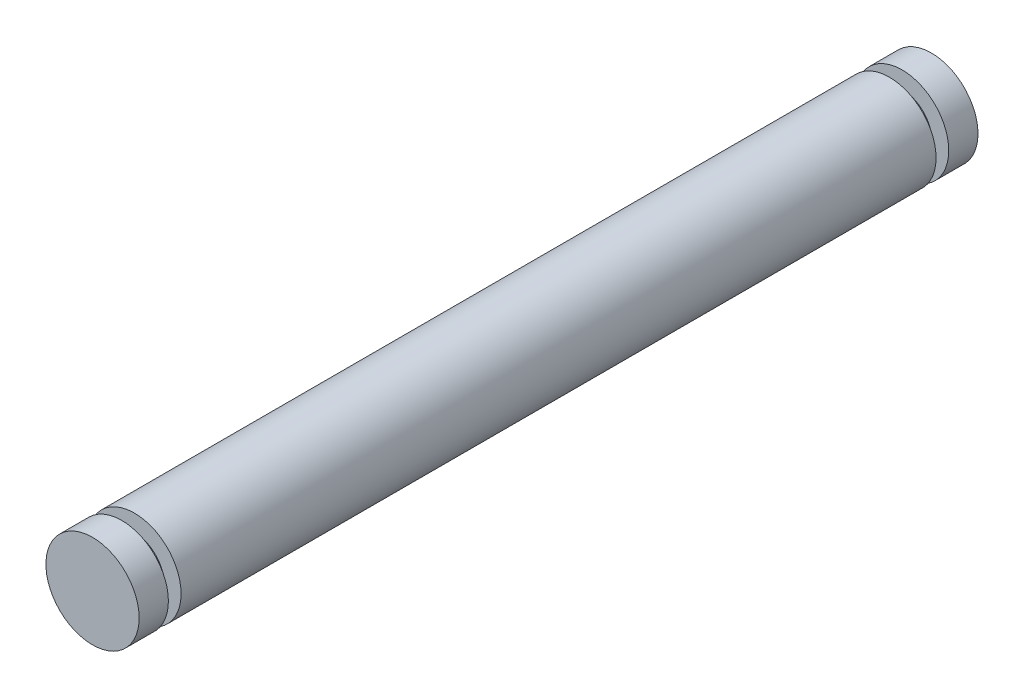
ISO-10303-21;
HEADER;
FILE_DESCRIPTION(('STEP AP214'),'2;1');
FILE_NAME('part.step','',(''),(''),'','','');
FILE_SCHEMA(('AUTOMOTIVE_DESIGN { 1 0 10303 214 1 1 1 1 }'));
ENDSEC;
DATA;
#1=APPLICATION_CONTEXT('core data for automotive mechanical design processes');
#2=APPLICATION_PROTOCOL_DEFINITION('international standard','automotive_design',2000,#1);
#3=PRODUCT_CONTEXT('',#1,'mechanical');
#4=PRODUCT('Part','Part','',(#3));
#5=PRODUCT_RELATED_PRODUCT_CATEGORY('part','',(#4));
#6=PRODUCT_DEFINITION_FORMATION('','',#4);
#7=PRODUCT_DEFINITION_CONTEXT('part definition',#1,'design');
#8=PRODUCT_DEFINITION('design','',#6,#7);
#9=PRODUCT_DEFINITION_SHAPE('','',#8);
#10=(LENGTH_UNIT() NAMED_UNIT(*) SI_UNIT(.MILLI.,.METRE.));
#11=(NAMED_UNIT(*) PLANE_ANGLE_UNIT() SI_UNIT($,.RADIAN.));
#12=(NAMED_UNIT(*) SI_UNIT($,.STERADIAN.) SOLID_ANGLE_UNIT());
#13=UNCERTAINTY_MEASURE_WITH_UNIT(LENGTH_MEASURE(1.E-05),#10,'distance_accuracy_value','');
#14=(GEOMETRIC_REPRESENTATION_CONTEXT(3) GLOBAL_UNCERTAINTY_ASSIGNED_CONTEXT((#13)) GLOBAL_UNIT_ASSIGNED_CONTEXT((#10,
#11,#12)) REPRESENTATION_CONTEXT('',''));
#15=CARTESIAN_POINT('',(0.,0.,0.));
#16=DIRECTION('',(0.,0.,1.));
#17=DIRECTION('',(1.,0.,0.));
#18=AXIS2_PLACEMENT_3D('',#15,#16,#17);
#19=CARTESIAN_POINT('',(0.,0.,-45.));
#20=DIRECTION('',(0.,0.,1.));
#21=DIRECTION('',(1.,0.,0.));
#22=AXIS2_PLACEMENT_3D('',#19,#20,#21);
#23=CYLINDRICAL_SURFACE('',#22,2.5);
#24=CARTESIAN_POINT('',(0.,0.,0.));
#25=DIRECTION('',(0.,0.,1.));
#26=DIRECTION('',(1.,0.,0.));
#27=AXIS2_PLACEMENT_3D('',#24,#25,#26);
#28=CIRCLE('',#27,2.5);
#29=CARTESIAN_POINT('',(2.5,0.,0.));
#30=VERTEX_POINT('',#29);
#31=EDGE_CURVE('E33',#30,#30,#28,.T.);
#32=ORIENTED_EDGE('',*,*,#31,.F.);
#33=EDGE_LOOP('',(#32));
#34=FACE_BOUND('',#33,.T.);
#35=CARTESIAN_POINT('',(0.,0.,-1.57000000000003));
#36=DIRECTION('',(0.,0.,1.));
#37=DIRECTION('',(1.,0.,0.));
#38=AXIS2_PLACEMENT_3D('',#35,#36,#37);
#39=CIRCLE('',#38,2.5);
#40=CARTESIAN_POINT('',(2.5,0.,-1.57000000000003));
#41=VERTEX_POINT('',#40);
#42=EDGE_CURVE('E40',#41,#41,#39,.T.);
#43=ORIENTED_EDGE('',*,*,#42,.T.);
#44=EDGE_LOOP('',(#43));
#45=FACE_BOUND('',#44,.T.);
#46=ADVANCED_FACE('F30',(#34,#45),#23,.T.);
#47=CARTESIAN_POINT('',(0.,0.,0.));
#48=DIRECTION('',(0.,0.,1.));
#49=DIRECTION('',(1.,0.,0.));
#50=AXIS2_PLACEMENT_3D('',#47,#48,#49);
#51=PLANE('',#50);
#52=ORIENTED_EDGE('',*,*,#31,.T.);
#53=EDGE_LOOP('',(#52));
#54=FACE_BOUND('',#53,.T.);
#55=ADVANCED_FACE('F88',(#54),#51,.T.);
#56=CARTESIAN_POINT('',(0.,2.5,-1.57000000000003));
#57=DIRECTION('',(0.,0.,-1.));
#58=DIRECTION('',(-1.,0.,0.));
#59=AXIS2_PLACEMENT_3D('',#56,#57,#58);
#60=PLANE('',#59);
#61=CARTESIAN_POINT('',(0.,0.,-1.57000000000003));
#62=DIRECTION('',(0.,0.,1.));
#63=DIRECTION('',(1.,0.,0.));
#64=AXIS2_PLACEMENT_3D('',#61,#62,#63);
#65=CIRCLE('',#64,1.6);
#66=CARTESIAN_POINT('',(1.6,0.,-1.57000000000003));
#67=VERTEX_POINT('',#66);
#68=EDGE_CURVE('E57',#67,#67,#65,.T.);
#69=ORIENTED_EDGE('',*,*,#68,.T.);
#70=EDGE_LOOP('',(#69));
#71=FACE_BOUND('',#70,.T.);
#72=ORIENTED_EDGE('',*,*,#42,.F.);
#73=EDGE_LOOP('',(#72));
#74=FACE_BOUND('',#73,.T.);
#75=ADVANCED_FACE('F95',(#71,#74),#60,.T.);
#76=CARTESIAN_POINT('',(0.,0.,0.));
#77=DIRECTION('',(0.,0.,1.));
#78=DIRECTION('',(1.,0.,0.));
#79=AXIS2_PLACEMENT_3D('',#76,#77,#78);
#80=CYLINDRICAL_SURFACE('',#79,1.6);
#81=CARTESIAN_POINT('',(0.,0.,-2.25000000000003));
#82=DIRECTION('',(0.,0.,1.));
#83=DIRECTION('',(1.,0.,0.));
#84=AXIS2_PLACEMENT_3D('',#81,#82,#83);
#85=CIRCLE('',#84,1.6);
#86=CARTESIAN_POINT('',(1.6,0.,-2.25000000000003));
#87=VERTEX_POINT('',#86);
#88=EDGE_CURVE('E60',#87,#87,#85,.T.);
#89=ORIENTED_EDGE('',*,*,#88,.T.);
#90=EDGE_LOOP('',(#89));
#91=FACE_BOUND('',#90,.T.);
#92=ORIENTED_EDGE('',*,*,#68,.F.);
#93=EDGE_LOOP('',(#92));
#94=FACE_BOUND('',#93,.T.);
#95=ADVANCED_FACE('F83',(#91,#94),#80,.T.);
#96=CARTESIAN_POINT('',(0.,1.6,-2.25000000000003));
#97=DIRECTION('',(0.,0.,1.));
#98=DIRECTION('',(1.,0.,0.));
#99=AXIS2_PLACEMENT_3D('',#96,#97,#98);
#100=PLANE('',#99);
#101=CARTESIAN_POINT('',(0.,0.,-2.25000000000003));
#102=DIRECTION('',(0.,0.,1.));
#103=DIRECTION('',(1.,0.,0.));
#104=AXIS2_PLACEMENT_3D('',#101,#102,#103);
#105=CIRCLE('',#104,2.5);
#106=CARTESIAN_POINT('',(2.5,0.,-2.25000000000003));
#107=VERTEX_POINT('',#106);
#108=EDGE_CURVE('E45',#107,#107,#105,.T.);
#109=ORIENTED_EDGE('',*,*,#108,.T.);
#110=EDGE_LOOP('',(#109));
#111=FACE_BOUND('',#110,.T.);
#112=ORIENTED_EDGE('',*,*,#88,.F.);
#113=EDGE_LOOP('',(#112));
#114=FACE_BOUND('',#113,.T.);
#115=ADVANCED_FACE('F66',(#111,#114),#100,.T.);
#116=CARTESIAN_POINT('',(0.,0.,-42.75));
#117=DIRECTION('',(0.,0.,1.));
#118=DIRECTION('',(1.,0.,0.));
#119=AXIS2_PLACEMENT_3D('',#116,#117,#118);
#120=CIRCLE('',#119,2.50000000000001);
#121=CARTESIAN_POINT('',(2.50000000000001,0.,-42.75));
#122=VERTEX_POINT('',#121);
#123=EDGE_CURVE('E49',#122,#122,#120,.T.);
#124=ORIENTED_EDGE('',*,*,#123,.T.);
#125=EDGE_LOOP('',(#124));
#126=FACE_BOUND('',#125,.T.);
#127=ORIENTED_EDGE('',*,*,#108,.F.);
#128=EDGE_LOOP('',(#127));
#129=FACE_BOUND('',#128,.T.);
#130=ADVANCED_FACE('F69',(#126,#129),#23,.T.);
#131=CARTESIAN_POINT('',(0.,2.50000000000001,-43.43));
#132=DIRECTION('',(0.,0.,1.));
#133=DIRECTION('',(1.,0.,0.));
#134=AXIS2_PLACEMENT_3D('',#131,#132,#133);
#135=PLANE('',#134);
#136=CARTESIAN_POINT('',(0.,0.,-43.43));
#137=DIRECTION('',(0.,0.,1.));
#138=DIRECTION('',(1.,0.,0.));
#139=AXIS2_PLACEMENT_3D('',#136,#137,#138);
#140=CIRCLE('',#139,2.50000000000001);
#141=CARTESIAN_POINT('',(2.50000000000001,0.,-43.43));
#142=VERTEX_POINT('',#141);
#143=EDGE_CURVE('E52',#142,#142,#140,.T.);
#144=ORIENTED_EDGE('',*,*,#143,.T.);
#145=EDGE_LOOP('',(#144));
#146=FACE_BOUND('',#145,.T.);
#147=CARTESIAN_POINT('',(0.,0.,-43.43));
#148=DIRECTION('',(0.,0.,1.));
#149=DIRECTION('',(1.,0.,0.));
#150=AXIS2_PLACEMENT_3D('',#147,#148,#149);
#151=CIRCLE('',#150,1.60000000000001);
#152=CARTESIAN_POINT('',(1.60000000000001,0.,-43.43));
#153=VERTEX_POINT('',#152);
#154=EDGE_CURVE('E42',#153,#153,#151,.T.);
#155=ORIENTED_EDGE('',*,*,#154,.F.);
#156=EDGE_LOOP('',(#155));
#157=FACE_BOUND('',#156,.T.);
#158=ADVANCED_FACE('F71',(#146,#157),#135,.T.);
#159=CARTESIAN_POINT('',(0.,0.,0.));
#160=DIRECTION('',(0.,0.,1.));
#161=DIRECTION('',(1.,0.,0.));
#162=AXIS2_PLACEMENT_3D('',#159,#160,#161);
#163=CYLINDRICAL_SURFACE('',#162,1.6);
#164=ORIENTED_EDGE('',*,*,#154,.T.);
#165=EDGE_LOOP('',(#164));
#166=FACE_BOUND('',#165,.T.);
#167=CARTESIAN_POINT('',(0.,0.,-42.75));
#168=DIRECTION('',(0.,0.,1.));
#169=DIRECTION('',(1.,0.,0.));
#170=AXIS2_PLACEMENT_3D('',#167,#168,#169);
#171=CIRCLE('',#170,1.6);
#172=CARTESIAN_POINT('',(1.6,0.,-42.75));
#173=VERTEX_POINT('',#172);
#174=EDGE_CURVE('E46',#173,#173,#171,.T.);
#175=ORIENTED_EDGE('',*,*,#174,.F.);
#176=EDGE_LOOP('',(#175));
#177=FACE_BOUND('',#176,.T.);
#178=ADVANCED_FACE('F79',(#166,#177),#163,.T.);
#179=CARTESIAN_POINT('',(0.,1.6,-42.75));
#180=DIRECTION('',(0.,0.,-1.));
#181=DIRECTION('',(-1.,0.,0.));
#182=AXIS2_PLACEMENT_3D('',#179,#180,#181);
#183=PLANE('',#182);
#184=ORIENTED_EDGE('',*,*,#174,.T.);
#185=EDGE_LOOP('',(#184));
#186=FACE_BOUND('',#185,.T.);
#187=ORIENTED_EDGE('',*,*,#123,.F.);
#188=EDGE_LOOP('',(#187));
#189=FACE_BOUND('',#188,.T.);
#190=ADVANCED_FACE('F109',(#186,#189),#183,.T.);
#191=CARTESIAN_POINT('',(0.,0.,-45.));
#192=DIRECTION('',(0.,0.,1.));
#193=DIRECTION('',(1.,0.,0.));
#194=AXIS2_PLACEMENT_3D('',#191,#192,#193);
#195=PLANE('',#194);
#196=CARTESIAN_POINT('',(0.,0.,-45.));
#197=DIRECTION('',(0.,0.,1.));
#198=DIRECTION('',(1.,0.,0.));
#199=AXIS2_PLACEMENT_3D('',#196,#197,#198);
#200=CIRCLE('',#199,2.5);
#201=CARTESIAN_POINT('',(2.5,0.,-45.));
#202=VERTEX_POINT('',#201);
#203=EDGE_CURVE('E10',#202,#202,#200,.T.);
#204=ORIENTED_EDGE('',*,*,#203,.F.);
#205=EDGE_LOOP('',(#204));
#206=FACE_BOUND('',#205,.T.);
#207=ADVANCED_FACE('F86',(#206),#195,.F.);
#208=ORIENTED_EDGE('',*,*,#203,.T.);
#209=EDGE_LOOP('',(#208));
#210=FACE_BOUND('',#209,.T.);
#211=ORIENTED_EDGE('',*,*,#143,.F.);
#212=EDGE_LOOP('',(#211));
#213=FACE_BOUND('',#212,.T.);
#214=ADVANCED_FACE('F73',(#210,#213),#23,.T.);
#215=CLOSED_SHELL('',(#46,#55,#75,#95,#115,#130,#158,#178,#190,#207,#214));
#216=MANIFOLD_SOLID_BREP('B2',#215);
#217=ADVANCED_BREP_SHAPE_REPRESENTATION('',(#18,#216),#14);
#218=SHAPE_DEFINITION_REPRESENTATION(#9,#217);
ENDSEC;
END-ISO-10303-21;
